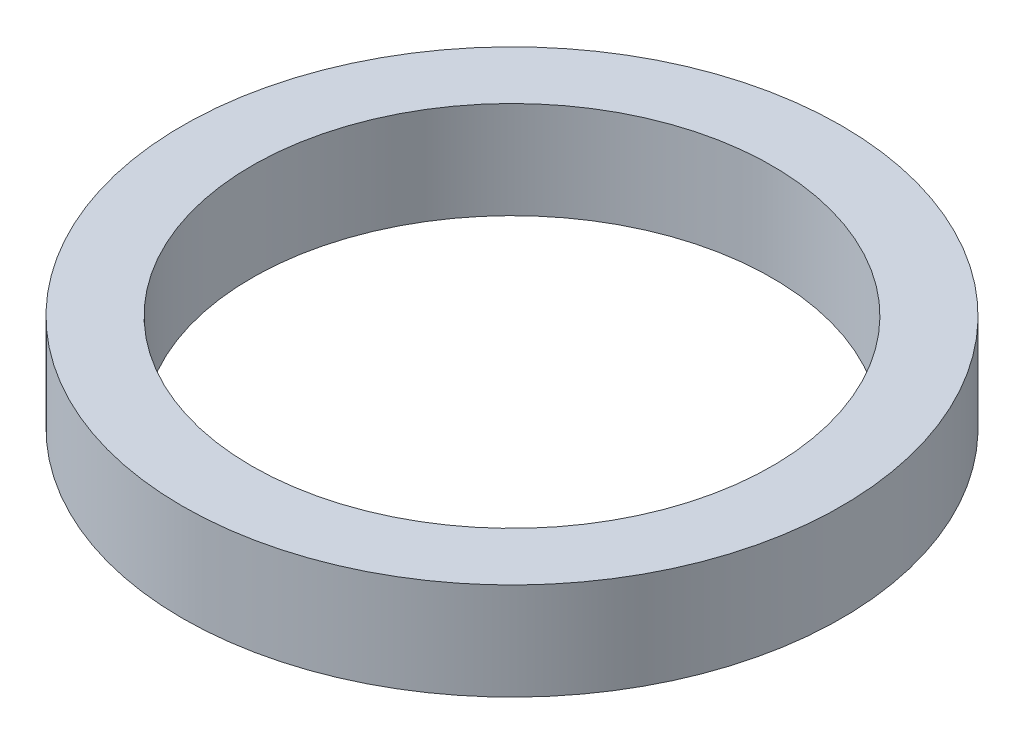
ISO-10303-21;
HEADER;
FILE_DESCRIPTION(('STEP AP214'),'2;1');
FILE_NAME('part.step','',(''),(''),'','','');
FILE_SCHEMA(('AUTOMOTIVE_DESIGN { 1 0 10303 214 1 1 1 1 }'));
ENDSEC;
DATA;
#1=APPLICATION_CONTEXT('core data for automotive mechanical design processes');
#2=APPLICATION_PROTOCOL_DEFINITION('international standard','automotive_design',2000,#1);
#3=PRODUCT_CONTEXT('',#1,'mechanical');
#4=PRODUCT('Part','Part','',(#3));
#5=PRODUCT_RELATED_PRODUCT_CATEGORY('part','',(#4));
#6=PRODUCT_DEFINITION_FORMATION('','',#4);
#7=PRODUCT_DEFINITION_CONTEXT('part definition',#1,'design');
#8=PRODUCT_DEFINITION('design','',#6,#7);
#9=PRODUCT_DEFINITION_SHAPE('','',#8);
#10=(LENGTH_UNIT() NAMED_UNIT(*) SI_UNIT(.MILLI.,.METRE.));
#11=(NAMED_UNIT(*) PLANE_ANGLE_UNIT() SI_UNIT($,.RADIAN.));
#12=(NAMED_UNIT(*) SI_UNIT($,.STERADIAN.) SOLID_ANGLE_UNIT());
#13=UNCERTAINTY_MEASURE_WITH_UNIT(LENGTH_MEASURE(1.E-05),#10,'distance_accuracy_value','');
#14=(GEOMETRIC_REPRESENTATION_CONTEXT(3) GLOBAL_UNCERTAINTY_ASSIGNED_CONTEXT((#13)) GLOBAL_UNIT_ASSIGNED_CONTEXT((#10,
#11,#12)) REPRESENTATION_CONTEXT('',''));
#15=CARTESIAN_POINT('',(0.,0.,0.));
#16=DIRECTION('',(0.,0.,1.));
#17=DIRECTION('',(1.,0.,0.));
#18=AXIS2_PLACEMENT_3D('',#15,#16,#17);
#19=CARTESIAN_POINT('',(0.,14.,0.));
#20=DIRECTION('',(0.,-1.,0.));
#21=DIRECTION('',(0.,0.,-1.));
#22=AXIS2_PLACEMENT_3D('',#19,#20,#21);
#23=CYLINDRICAL_SURFACE('',#22,47.5);
#24=CARTESIAN_POINT('',(0.,14.,0.));
#25=DIRECTION('',(0.,1.,0.));
#26=DIRECTION('',(0.,0.,1.));
#27=AXIS2_PLACEMENT_3D('',#24,#25,#26);
#28=CIRCLE('',#27,47.5);
#29=CARTESIAN_POINT('',(0.,14.,47.5));
#30=VERTEX_POINT('',#29);
#31=EDGE_CURVE('E10',#30,#30,#28,.T.);
#32=ORIENTED_EDGE('',*,*,#31,.F.);
#33=EDGE_LOOP('',(#32));
#34=FACE_BOUND('',#33,.T.);
#35=CARTESIAN_POINT('',(0.,0.,0.));
#36=DIRECTION('',(0.,1.,0.));
#37=DIRECTION('',(0.,0.,1.));
#38=AXIS2_PLACEMENT_3D('',#35,#36,#37);
#39=CIRCLE('',#38,47.5);
#40=CARTESIAN_POINT('',(0.,0.,47.5));
#41=VERTEX_POINT('',#40);
#42=EDGE_CURVE('E37',#41,#41,#39,.T.);
#43=ORIENTED_EDGE('',*,*,#42,.T.);
#44=EDGE_LOOP('',(#43));
#45=FACE_BOUND('',#44,.T.);
#46=ADVANCED_FACE('F40',(#34,#45),#23,.T.);
#47=CARTESIAN_POINT('',(0.,14.,0.));
#48=DIRECTION('',(0.,1.,0.));
#49=DIRECTION('',(0.,0.,1.));
#50=AXIS2_PLACEMENT_3D('',#47,#48,#49);
#51=PLANE('',#50);
#52=CARTESIAN_POINT('',(0.,14.,0.));
#53=DIRECTION('',(0.,1.,0.));
#54=DIRECTION('',(0.,0.,1.));
#55=AXIS2_PLACEMENT_3D('',#52,#53,#54);
#56=CIRCLE('',#55,37.5);
#57=CARTESIAN_POINT('',(0.,14.,37.5));
#58=VERTEX_POINT('',#57);
#59=EDGE_CURVE('E50',#58,#58,#56,.T.);
#60=ORIENTED_EDGE('',*,*,#59,.F.);
#61=EDGE_LOOP('',(#60));
#62=FACE_BOUND('',#61,.T.);
#63=ORIENTED_EDGE('',*,*,#31,.T.);
#64=EDGE_LOOP('',(#63));
#65=FACE_BOUND('',#64,.T.);
#66=ADVANCED_FACE('F59',(#62,#65),#51,.T.);
#67=CARTESIAN_POINT('',(0.,0.,0.));
#68=DIRECTION('',(0.,1.,0.));
#69=DIRECTION('',(0.,0.,1.));
#70=AXIS2_PLACEMENT_3D('',#67,#68,#69);
#71=PLANE('',#70);
#72=CARTESIAN_POINT('',(0.,0.,0.));
#73=DIRECTION('',(0.,1.,0.));
#74=DIRECTION('',(0.,0.,1.));
#75=AXIS2_PLACEMENT_3D('',#72,#73,#74);
#76=CIRCLE('',#75,37.5);
#77=CARTESIAN_POINT('',(0.,0.,37.5));
#78=VERTEX_POINT('',#77);
#79=EDGE_CURVE('E47',#78,#78,#76,.T.);
#80=ORIENTED_EDGE('',*,*,#79,.T.);
#81=EDGE_LOOP('',(#80));
#82=FACE_BOUND('',#81,.T.);
#83=ORIENTED_EDGE('',*,*,#42,.F.);
#84=EDGE_LOOP('',(#83));
#85=FACE_BOUND('',#84,.T.);
#86=ADVANCED_FACE('F58',(#82,#85),#71,.F.);
#87=CARTESIAN_POINT('',(0.,14.,0.));
#88=DIRECTION('',(0.,-1.,0.));
#89=DIRECTION('',(0.,0.,-1.));
#90=AXIS2_PLACEMENT_3D('',#87,#88,#89);
#91=CYLINDRICAL_SURFACE('',#90,37.5);
#92=ORIENTED_EDGE('',*,*,#59,.T.);
#93=EDGE_LOOP('',(#92));
#94=FACE_BOUND('',#93,.T.);
#95=ORIENTED_EDGE('',*,*,#79,.F.);
#96=EDGE_LOOP('',(#95));
#97=FACE_BOUND('',#96,.T.);
#98=ADVANCED_FACE('F54',(#94,#97),#91,.F.);
#99=CLOSED_SHELL('',(#46,#66,#86,#98));
#100=MANIFOLD_SOLID_BREP('B2',#99);
#101=ADVANCED_BREP_SHAPE_REPRESENTATION('',(#18,#100),#14);
#102=SHAPE_DEFINITION_REPRESENTATION(#9,#101);
ENDSEC;
END-ISO-10303-21;
